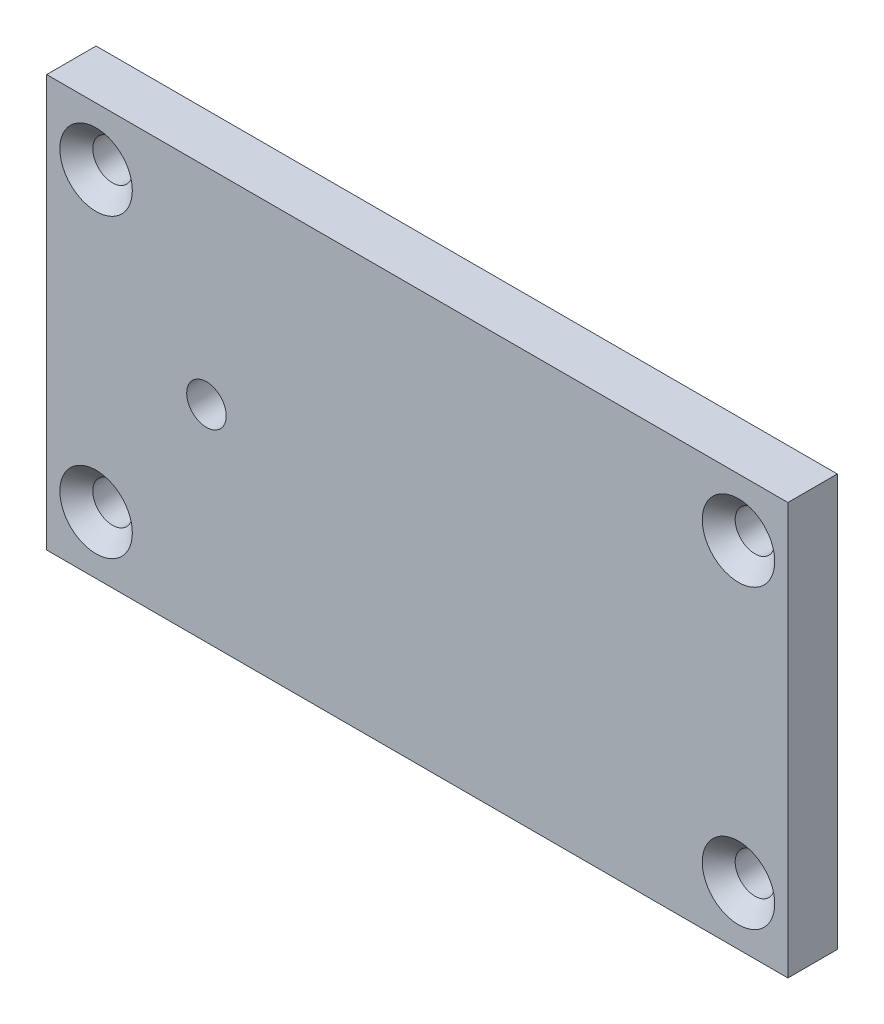
ISO-10303-21;
HEADER;
FILE_DESCRIPTION(('STEP AP214'),'2;1');
FILE_NAME('part.step','',(''),(''),'','','');
FILE_SCHEMA(('AUTOMOTIVE_DESIGN { 1 0 10303 214 1 1 1 1 }'));
ENDSEC;
DATA;
#1=APPLICATION_CONTEXT('core data for automotive mechanical design processes');
#2=APPLICATION_PROTOCOL_DEFINITION('international standard','automotive_design',2000,#1);
#3=PRODUCT_CONTEXT('',#1,'mechanical');
#4=PRODUCT('Part','Part','',(#3));
#5=PRODUCT_RELATED_PRODUCT_CATEGORY('part','',(#4));
#6=PRODUCT_DEFINITION_FORMATION('','',#4);
#7=PRODUCT_DEFINITION_CONTEXT('part definition',#1,'design');
#8=PRODUCT_DEFINITION('design','',#6,#7);
#9=PRODUCT_DEFINITION_SHAPE('','',#8);
#10=(LENGTH_UNIT() NAMED_UNIT(*) SI_UNIT(.MILLI.,.METRE.));
#11=(NAMED_UNIT(*) PLANE_ANGLE_UNIT() SI_UNIT($,.RADIAN.));
#12=(NAMED_UNIT(*) SI_UNIT($,.STERADIAN.) SOLID_ANGLE_UNIT());
#13=UNCERTAINTY_MEASURE_WITH_UNIT(LENGTH_MEASURE(1.E-05),#10,'distance_accuracy_value','');
#14=(GEOMETRIC_REPRESENTATION_CONTEXT(3) GLOBAL_UNCERTAINTY_ASSIGNED_CONTEXT((#13)) GLOBAL_UNIT_ASSIGNED_CONTEXT((#10,
#11,#12)) REPRESENTATION_CONTEXT('',''));
#15=CARTESIAN_POINT('',(0.,0.,0.));
#16=DIRECTION('',(0.,0.,1.));
#17=DIRECTION('',(1.,0.,0.));
#18=AXIS2_PLACEMENT_3D('',#15,#16,#17);
#19=CARTESIAN_POINT('',(-22.5,-12.5,3.));
#20=DIRECTION('',(1.,0.,0.));
#21=DIRECTION('',(0.,0.,-1.));
#22=AXIS2_PLACEMENT_3D('',#19,#20,#21);
#23=PLANE('',#22);
#24=DIRECTION('',(0.,-1.,0.));
#25=VECTOR('',#24,1.);
#26=CARTESIAN_POINT('',(-22.5,-12.5,0.));
#27=LINE('',#26,#25);
#28=CARTESIAN_POINT('',(-22.5,12.5,0.));
#29=VERTEX_POINT('',#28);
#30=CARTESIAN_POINT('',(-22.5,-12.5,0.));
#31=VERTEX_POINT('',#30);
#32=EDGE_CURVE('E96',#29,#31,#27,.T.);
#33=ORIENTED_EDGE('',*,*,#32,.T.);
#34=DIRECTION('',(0.,0.,-1.));
#35=VECTOR('',#34,1.);
#36=CARTESIAN_POINT('',(-22.5,-12.5,3.));
#37=LINE('',#36,#35);
#38=CARTESIAN_POINT('',(-22.5,-12.5,3.));
#39=VERTEX_POINT('',#38);
#40=EDGE_CURVE('E11',#39,#31,#37,.T.);
#41=ORIENTED_EDGE('',*,*,#40,.F.);
#42=DIRECTION('',(0.,-1.,0.));
#43=VECTOR('',#42,1.);
#44=CARTESIAN_POINT('',(-22.5,-12.5,3.));
#45=LINE('',#44,#43);
#46=CARTESIAN_POINT('',(-22.5,12.5,3.));
#47=VERTEX_POINT('',#46);
#48=EDGE_CURVE('E84',#47,#39,#45,.T.);
#49=ORIENTED_EDGE('',*,*,#48,.F.);
#50=DIRECTION('',(0.,0.,-1.));
#51=VECTOR('',#50,1.);
#52=CARTESIAN_POINT('',(-22.5,12.5,3.));
#53=LINE('',#52,#51);
#54=EDGE_CURVE('E92',#47,#29,#53,.T.);
#55=ORIENTED_EDGE('',*,*,#54,.T.);
#56=EDGE_LOOP('',(#33,#41,#49,#55));
#57=FACE_BOUND('',#56,.T.);
#58=ADVANCED_FACE('F33',(#57),#23,.F.);
#59=CARTESIAN_POINT('',(22.5,-12.5,3.));
#60=DIRECTION('',(0.,1.,0.));
#61=DIRECTION('',(-1.,0.,0.));
#62=AXIS2_PLACEMENT_3D('',#59,#60,#61);
#63=PLANE('',#62);
#64=DIRECTION('',(1.,0.,0.));
#65=VECTOR('',#64,1.);
#66=CARTESIAN_POINT('',(22.5,-12.5,0.));
#67=LINE('',#66,#65);
#68=CARTESIAN_POINT('',(22.5,-12.5,0.));
#69=VERTEX_POINT('',#68);
#70=EDGE_CURVE('E88',#31,#69,#67,.T.);
#71=ORIENTED_EDGE('',*,*,#70,.T.);
#72=DIRECTION('',(0.,0.,-1.));
#73=VECTOR('',#72,1.);
#74=CARTESIAN_POINT('',(22.5,-12.5,3.));
#75=LINE('',#74,#73);
#76=CARTESIAN_POINT('',(22.5,-12.5,3.));
#77=VERTEX_POINT('',#76);
#78=EDGE_CURVE('E41',#77,#69,#75,.T.);
#79=ORIENTED_EDGE('',*,*,#78,.F.);
#80=DIRECTION('',(1.,0.,0.));
#81=VECTOR('',#80,1.);
#82=CARTESIAN_POINT('',(22.5,-12.5,3.));
#83=LINE('',#82,#81);
#84=EDGE_CURVE('E79',#39,#77,#83,.T.);
#85=ORIENTED_EDGE('',*,*,#84,.F.);
#86=ORIENTED_EDGE('',*,*,#40,.T.);
#87=EDGE_LOOP('',(#71,#79,#85,#86));
#88=FACE_BOUND('',#87,.T.);
#89=ADVANCED_FACE('F87',(#88),#63,.F.);
#90=CARTESIAN_POINT('',(22.5,-12.5,3.));
#91=DIRECTION('',(-1.,0.,0.));
#92=DIRECTION('',(0.,0.,1.));
#93=AXIS2_PLACEMENT_3D('',#90,#91,#92);
#94=PLANE('',#93);
#95=DIRECTION('',(0.,1.,0.));
#96=VECTOR('',#95,1.);
#97=CARTESIAN_POINT('',(22.5,-12.5,0.));
#98=LINE('',#97,#96);
#99=CARTESIAN_POINT('',(22.5,12.5,0.));
#100=VERTEX_POINT('',#99);
#101=EDGE_CURVE('E66',#69,#100,#98,.T.);
#102=ORIENTED_EDGE('',*,*,#101,.T.);
#103=DIRECTION('',(0.,0.,-1.));
#104=VECTOR('',#103,1.);
#105=CARTESIAN_POINT('',(22.5,12.5,3.));
#106=LINE('',#105,#104);
#107=CARTESIAN_POINT('',(22.5,12.5,3.));
#108=VERTEX_POINT('',#107);
#109=EDGE_CURVE('E89',#108,#100,#106,.T.);
#110=ORIENTED_EDGE('',*,*,#109,.F.);
#111=DIRECTION('',(0.,1.,0.));
#112=VECTOR('',#111,1.);
#113=CARTESIAN_POINT('',(22.5,-12.5,3.));
#114=LINE('',#113,#112);
#115=EDGE_CURVE('E82',#77,#108,#114,.T.);
#116=ORIENTED_EDGE('',*,*,#115,.F.);
#117=ORIENTED_EDGE('',*,*,#78,.T.);
#118=EDGE_LOOP('',(#102,#110,#116,#117));
#119=FACE_BOUND('',#118,.T.);
#120=ADVANCED_FACE('F90',(#119),#94,.F.);
#121=CARTESIAN_POINT('',(22.5,12.5,3.));
#122=DIRECTION('',(0.,-1.,0.));
#123=DIRECTION('',(1.,0.,0.));
#124=AXIS2_PLACEMENT_3D('',#121,#122,#123);
#125=PLANE('',#124);
#126=DIRECTION('',(-1.,0.,0.));
#127=VECTOR('',#126,1.);
#128=CARTESIAN_POINT('',(22.5,12.5,0.));
#129=LINE('',#128,#127);
#130=EDGE_CURVE('E72',#100,#29,#129,.T.);
#131=ORIENTED_EDGE('',*,*,#130,.T.);
#132=ORIENTED_EDGE('',*,*,#54,.F.);
#133=DIRECTION('',(-1.,0.,0.));
#134=VECTOR('',#133,1.);
#135=CARTESIAN_POINT('',(22.5,12.5,3.));
#136=LINE('',#135,#134);
#137=EDGE_CURVE('E49',#108,#47,#136,.T.);
#138=ORIENTED_EDGE('',*,*,#137,.F.);
#139=ORIENTED_EDGE('',*,*,#109,.T.);
#140=EDGE_LOOP('',(#131,#132,#138,#139));
#141=FACE_BOUND('',#140,.T.);
#142=ADVANCED_FACE('F104',(#141),#125,.F.);
#143=CARTESIAN_POINT('',(0.,0.,3.));
#144=DIRECTION('',(0.,0.,1.));
#145=DIRECTION('',(1.,0.,0.));
#146=AXIS2_PLACEMENT_3D('',#143,#144,#145);
#147=PLANE('',#146);
#148=CARTESIAN_POINT('',(-12.8,0.,3.));
#149=DIRECTION('',(0.,0.,-1.));
#150=DIRECTION('',(-1.,0.,0.));
#151=AXIS2_PLACEMENT_3D('',#148,#149,#150);
#152=CIRCLE('',#151,1.19999999999999);
#153=CARTESIAN_POINT('',(-14.,0.,3.));
#154=VERTEX_POINT('',#153);
#155=EDGE_CURVE('E145',#154,#154,#152,.T.);
#156=ORIENTED_EDGE('',*,*,#155,.T.);
#157=EDGE_LOOP('',(#156));
#158=FACE_BOUND('',#157,.T.);
#159=CARTESIAN_POINT('',(-19.5,9.,3.));
#160=DIRECTION('',(0.,0.,1.));
#161=DIRECTION('',(1.,0.,0.));
#162=AXIS2_PLACEMENT_3D('',#159,#160,#161);
#163=CIRCLE('',#162,2.2);
#164=CARTESIAN_POINT('',(-17.3,9.,3.));
#165=VERTEX_POINT('',#164);
#166=EDGE_CURVE('E142',#165,#165,#163,.T.);
#167=ORIENTED_EDGE('',*,*,#166,.F.);
#168=EDGE_LOOP('',(#167));
#169=FACE_BOUND('',#168,.T.);
#170=CARTESIAN_POINT('',(19.5,9.,3.));
#171=DIRECTION('',(0.,0.,1.));
#172=DIRECTION('',(1.,0.,0.));
#173=AXIS2_PLACEMENT_3D('',#170,#171,#172);
#174=CIRCLE('',#173,2.2);
#175=CARTESIAN_POINT('',(21.7,9.,3.));
#176=VERTEX_POINT('',#175);
#177=EDGE_CURVE('E133',#176,#176,#174,.T.);
#178=ORIENTED_EDGE('',*,*,#177,.F.);
#179=EDGE_LOOP('',(#178));
#180=FACE_BOUND('',#179,.T.);
#181=CARTESIAN_POINT('',(19.5,-9.,3.));
#182=DIRECTION('',(0.,0.,1.));
#183=DIRECTION('',(1.,0.,0.));
#184=AXIS2_PLACEMENT_3D('',#181,#182,#183);
#185=CIRCLE('',#184,2.2);
#186=CARTESIAN_POINT('',(21.7,-9.,3.));
#187=VERTEX_POINT('',#186);
#188=EDGE_CURVE('E124',#187,#187,#185,.T.);
#189=ORIENTED_EDGE('',*,*,#188,.F.);
#190=EDGE_LOOP('',(#189));
#191=FACE_BOUND('',#190,.T.);
#192=CARTESIAN_POINT('',(-19.5,-9.00000000000001,3.));
#193=DIRECTION('',(0.,0.,1.));
#194=DIRECTION('',(1.,0.,0.));
#195=AXIS2_PLACEMENT_3D('',#192,#193,#194);
#196=CIRCLE('',#195,2.2);
#197=CARTESIAN_POINT('',(-17.3,-9.00000000000001,3.));
#198=VERTEX_POINT('',#197);
#199=EDGE_CURVE('E115',#198,#198,#196,.T.);
#200=ORIENTED_EDGE('',*,*,#199,.F.);
#201=EDGE_LOOP('',(#200));
#202=FACE_BOUND('',#201,.T.);
#203=ORIENTED_EDGE('',*,*,#48,.T.);
#204=ORIENTED_EDGE('',*,*,#84,.T.);
#205=ORIENTED_EDGE('',*,*,#115,.T.);
#206=ORIENTED_EDGE('',*,*,#137,.T.);
#207=EDGE_LOOP('',(#203,#204,#205,#206));
#208=FACE_BOUND('',#207,.T.);
#209=ADVANCED_FACE('F80',(#158,#169,#180,#191,#202,#208),#147,.T.);
#210=CARTESIAN_POINT('',(0.,0.,0.));
#211=DIRECTION('',(0.,0.,1.));
#212=DIRECTION('',(1.,0.,0.));
#213=AXIS2_PLACEMENT_3D('',#210,#211,#212);
#214=PLANE('',#213);
#215=CARTESIAN_POINT('',(-12.8,0.,0.));
#216=DIRECTION('',(0.,0.,-1.));
#217=DIRECTION('',(-1.,0.,0.));
#218=AXIS2_PLACEMENT_3D('',#215,#216,#217);
#219=CIRCLE('',#218,2.2);
#220=CARTESIAN_POINT('',(-15.,0.,0.));
#221=VERTEX_POINT('',#220);
#222=EDGE_CURVE('E151',#221,#221,#219,.T.);
#223=ORIENTED_EDGE('',*,*,#222,.F.);
#224=EDGE_LOOP('',(#223));
#225=FACE_BOUND('',#224,.T.);
#226=CARTESIAN_POINT('',(-19.5,9.,0.));
#227=DIRECTION('',(0.,0.,1.));
#228=DIRECTION('',(1.,0.,0.));
#229=AXIS2_PLACEMENT_3D('',#226,#227,#228);
#230=CIRCLE('',#229,1.19999999999999);
#231=CARTESIAN_POINT('',(-18.3,9.,0.));
#232=VERTEX_POINT('',#231);
#233=EDGE_CURVE('E136',#232,#232,#230,.T.);
#234=ORIENTED_EDGE('',*,*,#233,.T.);
#235=EDGE_LOOP('',(#234));
#236=FACE_BOUND('',#235,.T.);
#237=CARTESIAN_POINT('',(19.5,9.,0.));
#238=DIRECTION('',(0.,0.,1.));
#239=DIRECTION('',(1.,0.,0.));
#240=AXIS2_PLACEMENT_3D('',#237,#238,#239);
#241=CIRCLE('',#240,1.19999999999999);
#242=CARTESIAN_POINT('',(20.7,9.,0.));
#243=VERTEX_POINT('',#242);
#244=EDGE_CURVE('E127',#243,#243,#241,.T.);
#245=ORIENTED_EDGE('',*,*,#244,.T.);
#246=EDGE_LOOP('',(#245));
#247=FACE_BOUND('',#246,.T.);
#248=CARTESIAN_POINT('',(19.5,-9.,0.));
#249=DIRECTION('',(0.,0.,1.));
#250=DIRECTION('',(1.,0.,0.));
#251=AXIS2_PLACEMENT_3D('',#248,#249,#250);
#252=CIRCLE('',#251,1.19999999999999);
#253=CARTESIAN_POINT('',(20.7,-9.,0.));
#254=VERTEX_POINT('',#253);
#255=EDGE_CURVE('E118',#254,#254,#252,.T.);
#256=ORIENTED_EDGE('',*,*,#255,.T.);
#257=EDGE_LOOP('',(#256));
#258=FACE_BOUND('',#257,.T.);
#259=CARTESIAN_POINT('',(-19.5,-9.00000000000001,0.));
#260=DIRECTION('',(0.,0.,1.));
#261=DIRECTION('',(1.,0.,0.));
#262=AXIS2_PLACEMENT_3D('',#259,#260,#261);
#263=CIRCLE('',#262,1.19999999999999);
#264=CARTESIAN_POINT('',(-18.3,-9.00000000000001,0.));
#265=VERTEX_POINT('',#264);
#266=EDGE_CURVE('E99',#265,#265,#263,.T.);
#267=ORIENTED_EDGE('',*,*,#266,.T.);
#268=EDGE_LOOP('',(#267));
#269=FACE_BOUND('',#268,.T.);
#270=ORIENTED_EDGE('',*,*,#32,.F.);
#271=ORIENTED_EDGE('',*,*,#130,.F.);
#272=ORIENTED_EDGE('',*,*,#101,.F.);
#273=ORIENTED_EDGE('',*,*,#70,.F.);
#274=EDGE_LOOP('',(#270,#271,#272,#273));
#275=FACE_BOUND('',#274,.T.);
#276=ADVANCED_FACE('F107',(#225,#236,#247,#258,#269,#275),#214,.F.);
#277=CARTESIAN_POINT('',(-19.5,-9.00000000000001,3.));
#278=DIRECTION('',(0.,0.,1.));
#279=DIRECTION('',(1.,0.,0.));
#280=AXIS2_PLACEMENT_3D('',#277,#278,#279);
#281=CYLINDRICAL_SURFACE('',#280,1.19999999999999);
#282=ORIENTED_EDGE('',*,*,#266,.F.);
#283=EDGE_LOOP('',(#282));
#284=FACE_BOUND('',#283,.T.);
#285=CARTESIAN_POINT('',(-19.5,-9.00000000000001,2.));
#286=DIRECTION('',(0.,0.,1.));
#287=DIRECTION('',(1.,0.,0.));
#288=AXIS2_PLACEMENT_3D('',#285,#286,#287);
#289=CIRCLE('',#288,1.19999999999999);
#290=CARTESIAN_POINT('',(-18.3,-9.00000000000001,2.));
#291=VERTEX_POINT('',#290);
#292=EDGE_CURVE('E112',#291,#291,#289,.T.);
#293=ORIENTED_EDGE('',*,*,#292,.T.);
#294=EDGE_LOOP('',(#293));
#295=FACE_BOUND('',#294,.T.);
#296=ADVANCED_FACE('F159',(#284,#295),#281,.F.);
#297=CARTESIAN_POINT('',(-19.5,-9.00000000000001,3.));
#298=DIRECTION('',(0.,0.,1.));
#299=DIRECTION('',(1.,0.,0.));
#300=AXIS2_PLACEMENT_3D('',#297,#298,#299);
#301=CONICAL_SURFACE('',#300,2.2,0.785398163397453);
#302=ORIENTED_EDGE('',*,*,#292,.F.);
#303=EDGE_LOOP('',(#302));
#304=FACE_BOUND('',#303,.T.);
#305=ORIENTED_EDGE('',*,*,#199,.T.);
#306=EDGE_LOOP('',(#305));
#307=FACE_BOUND('',#306,.T.);
#308=ADVANCED_FACE('F171',(#304,#307),#301,.F.);
#309=CARTESIAN_POINT('',(19.5,-9.,3.));
#310=DIRECTION('',(0.,0.,1.));
#311=DIRECTION('',(1.,0.,0.));
#312=AXIS2_PLACEMENT_3D('',#309,#310,#311);
#313=CYLINDRICAL_SURFACE('',#312,1.19999999999999);
#314=ORIENTED_EDGE('',*,*,#255,.F.);
#315=EDGE_LOOP('',(#314));
#316=FACE_BOUND('',#315,.T.);
#317=CARTESIAN_POINT('',(19.5,-9.,2.));
#318=DIRECTION('',(0.,0.,1.));
#319=DIRECTION('',(1.,0.,0.));
#320=AXIS2_PLACEMENT_3D('',#317,#318,#319);
#321=CIRCLE('',#320,1.19999999999999);
#322=CARTESIAN_POINT('',(20.7,-9.,2.));
#323=VERTEX_POINT('',#322);
#324=EDGE_CURVE('E121',#323,#323,#321,.T.);
#325=ORIENTED_EDGE('',*,*,#324,.T.);
#326=EDGE_LOOP('',(#325));
#327=FACE_BOUND('',#326,.T.);
#328=ADVANCED_FACE('F177',(#316,#327),#313,.F.);
#329=CARTESIAN_POINT('',(19.5,-9.,3.));
#330=DIRECTION('',(0.,0.,1.));
#331=DIRECTION('',(1.,0.,0.));
#332=AXIS2_PLACEMENT_3D('',#329,#330,#331);
#333=CONICAL_SURFACE('',#332,2.2,0.785398163397453);
#334=ORIENTED_EDGE('',*,*,#324,.F.);
#335=EDGE_LOOP('',(#334));
#336=FACE_BOUND('',#335,.T.);
#337=ORIENTED_EDGE('',*,*,#188,.T.);
#338=EDGE_LOOP('',(#337));
#339=FACE_BOUND('',#338,.T.);
#340=ADVANCED_FACE('F229',(#336,#339),#333,.F.);
#341=CARTESIAN_POINT('',(19.5,9.,3.));
#342=DIRECTION('',(0.,0.,1.));
#343=DIRECTION('',(1.,0.,0.));
#344=AXIS2_PLACEMENT_3D('',#341,#342,#343);
#345=CYLINDRICAL_SURFACE('',#344,1.19999999999999);
#346=ORIENTED_EDGE('',*,*,#244,.F.);
#347=EDGE_LOOP('',(#346));
#348=FACE_BOUND('',#347,.T.);
#349=CARTESIAN_POINT('',(19.5,9.,2.));
#350=DIRECTION('',(0.,0.,1.));
#351=DIRECTION('',(1.,0.,0.));
#352=AXIS2_PLACEMENT_3D('',#349,#350,#351);
#353=CIRCLE('',#352,1.19999999999999);
#354=CARTESIAN_POINT('',(20.7,9.,2.));
#355=VERTEX_POINT('',#354);
#356=EDGE_CURVE('E130',#355,#355,#353,.T.);
#357=ORIENTED_EDGE('',*,*,#356,.T.);
#358=EDGE_LOOP('',(#357));
#359=FACE_BOUND('',#358,.T.);
#360=ADVANCED_FACE('F237',(#348,#359),#345,.F.);
#361=CARTESIAN_POINT('',(19.5,9.,3.));
#362=DIRECTION('',(0.,0.,1.));
#363=DIRECTION('',(1.,0.,0.));
#364=AXIS2_PLACEMENT_3D('',#361,#362,#363);
#365=CONICAL_SURFACE('',#364,2.2,0.785398163397454);
#366=ORIENTED_EDGE('',*,*,#356,.F.);
#367=EDGE_LOOP('',(#366));
#368=FACE_BOUND('',#367,.T.);
#369=ORIENTED_EDGE('',*,*,#177,.T.);
#370=EDGE_LOOP('',(#369));
#371=FACE_BOUND('',#370,.T.);
#372=ADVANCED_FACE('F245',(#368,#371),#365,.F.);
#373=CARTESIAN_POINT('',(-19.5,9.,3.));
#374=DIRECTION('',(0.,0.,1.));
#375=DIRECTION('',(1.,0.,0.));
#376=AXIS2_PLACEMENT_3D('',#373,#374,#375);
#377=CYLINDRICAL_SURFACE('',#376,1.19999999999999);
#378=ORIENTED_EDGE('',*,*,#233,.F.);
#379=EDGE_LOOP('',(#378));
#380=FACE_BOUND('',#379,.T.);
#381=CARTESIAN_POINT('',(-19.5,9.,2.));
#382=DIRECTION('',(0.,0.,1.));
#383=DIRECTION('',(1.,0.,0.));
#384=AXIS2_PLACEMENT_3D('',#381,#382,#383);
#385=CIRCLE('',#384,1.19999999999999);
#386=CARTESIAN_POINT('',(-18.3,9.,2.));
#387=VERTEX_POINT('',#386);
#388=EDGE_CURVE('E139',#387,#387,#385,.T.);
#389=ORIENTED_EDGE('',*,*,#388,.T.);
#390=EDGE_LOOP('',(#389));
#391=FACE_BOUND('',#390,.T.);
#392=ADVANCED_FACE('F253',(#380,#391),#377,.F.);
#393=CARTESIAN_POINT('',(-19.5,9.,3.));
#394=DIRECTION('',(0.,0.,1.));
#395=DIRECTION('',(1.,0.,0.));
#396=AXIS2_PLACEMENT_3D('',#393,#394,#395);
#397=CONICAL_SURFACE('',#396,2.2,0.785398163397454);
#398=ORIENTED_EDGE('',*,*,#388,.F.);
#399=EDGE_LOOP('',(#398));
#400=FACE_BOUND('',#399,.T.);
#401=ORIENTED_EDGE('',*,*,#166,.T.);
#402=EDGE_LOOP('',(#401));
#403=FACE_BOUND('',#402,.T.);
#404=ADVANCED_FACE('F261',(#400,#403),#397,.F.);
#405=CARTESIAN_POINT('',(-12.8,0.,0.));
#406=DIRECTION('',(0.,0.,-1.));
#407=DIRECTION('',(-1.,0.,0.));
#408=AXIS2_PLACEMENT_3D('',#405,#406,#407);
#409=CYLINDRICAL_SURFACE('',#408,1.19999999999999);
#410=ORIENTED_EDGE('',*,*,#155,.F.);
#411=EDGE_LOOP('',(#410));
#412=FACE_BOUND('',#411,.T.);
#413=CARTESIAN_POINT('',(-12.8,0.,1.));
#414=DIRECTION('',(0.,0.,-1.));
#415=DIRECTION('',(-1.,0.,0.));
#416=AXIS2_PLACEMENT_3D('',#413,#414,#415);
#417=CIRCLE('',#416,1.19999999999999);
#418=CARTESIAN_POINT('',(-14.,0.,1.));
#419=VERTEX_POINT('',#418);
#420=EDGE_CURVE('E148',#419,#419,#417,.T.);
#421=ORIENTED_EDGE('',*,*,#420,.T.);
#422=EDGE_LOOP('',(#421));
#423=FACE_BOUND('',#422,.T.);
#424=ADVANCED_FACE('F268',(#412,#423),#409,.F.);
#425=CARTESIAN_POINT('',(-12.8,0.,0.));
#426=DIRECTION('',(0.,0.,-1.));
#427=DIRECTION('',(-1.,0.,0.));
#428=AXIS2_PLACEMENT_3D('',#425,#426,#427);
#429=CONICAL_SURFACE('',#428,2.2,0.785398163397453);
#430=ORIENTED_EDGE('',*,*,#420,.F.);
#431=EDGE_LOOP('',(#430));
#432=FACE_BOUND('',#431,.T.);
#433=ORIENTED_EDGE('',*,*,#222,.T.);
#434=EDGE_LOOP('',(#433));
#435=FACE_BOUND('',#434,.T.);
#436=ADVANCED_FACE('F155',(#432,#435),#429,.F.);
#437=CLOSED_SHELL('',(#58,#89,#120,#142,#209,#276,#296,#308,#328,#340,#360,#372,#392,#404,#424,#436));
#438=MANIFOLD_SOLID_BREP('B2',#437);
#439=ADVANCED_BREP_SHAPE_REPRESENTATION('',(#18,#438),#14);
#440=SHAPE_DEFINITION_REPRESENTATION(#9,#439);
ENDSEC;
END-ISO-10303-21;
